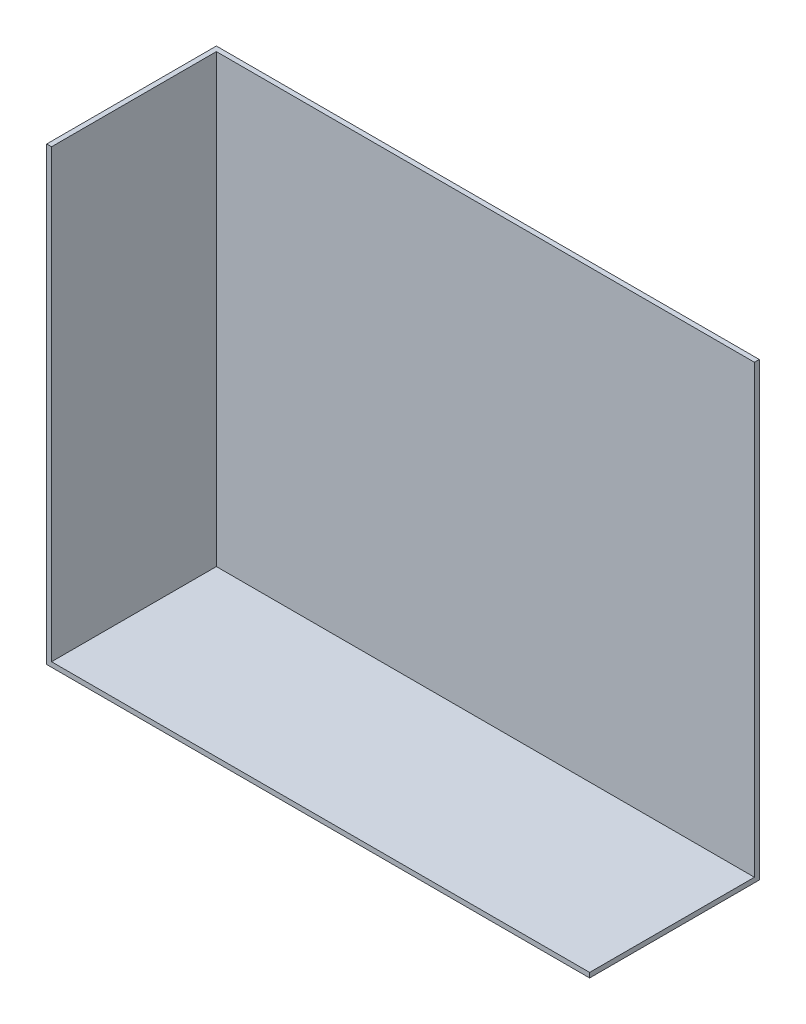
ISO-10303-21;
HEADER;
FILE_DESCRIPTION(('STEP AP214'),'2;1');
FILE_NAME('part.step','',(''),(''),'','','');
FILE_SCHEMA(('AUTOMOTIVE_DESIGN { 1 0 10303 214 1 1 1 1 }'));
ENDSEC;
DATA;
#1=APPLICATION_CONTEXT('core data for automotive mechanical design processes');
#2=APPLICATION_PROTOCOL_DEFINITION('international standard','automotive_design',2000,#1);
#3=PRODUCT_CONTEXT('',#1,'mechanical');
#4=PRODUCT('Part','Part','',(#3));
#5=PRODUCT_RELATED_PRODUCT_CATEGORY('part','',(#4));
#6=PRODUCT_DEFINITION_FORMATION('','',#4);
#7=PRODUCT_DEFINITION_CONTEXT('part definition',#1,'design');
#8=PRODUCT_DEFINITION('design','',#6,#7);
#9=PRODUCT_DEFINITION_SHAPE('','',#8);
#10=(LENGTH_UNIT() NAMED_UNIT(*) SI_UNIT(.MILLI.,.METRE.));
#11=(NAMED_UNIT(*) PLANE_ANGLE_UNIT() SI_UNIT($,.RADIAN.));
#12=(NAMED_UNIT(*) SI_UNIT($,.STERADIAN.) SOLID_ANGLE_UNIT());
#13=UNCERTAINTY_MEASURE_WITH_UNIT(LENGTH_MEASURE(1.E-05),#10,'distance_accuracy_value','');
#14=(GEOMETRIC_REPRESENTATION_CONTEXT(3) GLOBAL_UNCERTAINTY_ASSIGNED_CONTEXT((#13)) GLOBAL_UNIT_ASSIGNED_CONTEXT((#10,
#11,#12)) REPRESENTATION_CONTEXT('',''));
#15=CARTESIAN_POINT('',(0.,0.,0.));
#16=DIRECTION('',(0.,0.,1.));
#17=DIRECTION('',(1.,0.,0.));
#18=AXIS2_PLACEMENT_3D('',#15,#16,#17);
#19=CARTESIAN_POINT('',(1422.4,2362.2,444.5));
#20=DIRECTION('',(0.,0.,-1.));
#21=DIRECTION('',(-1.,0.,0.));
#22=AXIS2_PLACEMENT_3D('',#19,#20,#21);
#23=PLANE('',#22);
#24=DIRECTION('',(1.,0.,0.));
#25=VECTOR('',#24,1.);
#26=CARTESIAN_POINT('',(0.,25.4000000000001,444.5));
#27=LINE('',#26,#25);
#28=CARTESIAN_POINT('',(-1397.,25.4000000000001,444.5));
#29=VERTEX_POINT('',#28);
#30=CARTESIAN_POINT('',(1422.4,25.3999999999999,444.5));
#31=VERTEX_POINT('',#30);
#32=EDGE_CURVE('E130',#29,#31,#27,.T.);
#33=ORIENTED_EDGE('',*,*,#32,.F.);
#34=DIRECTION('',(0.,-1.,0.));
#35=VECTOR('',#34,1.);
#36=CARTESIAN_POINT('',(-1397.,2362.2,444.5));
#37=LINE('',#36,#35);
#38=CARTESIAN_POINT('',(-1397.,2362.2,444.5));
#39=VERTEX_POINT('',#38);
#40=EDGE_CURVE('E128',#39,#29,#37,.T.);
#41=ORIENTED_EDGE('',*,*,#40,.F.);
#42=DIRECTION('',(1.,0.,0.));
#43=VECTOR('',#42,1.);
#44=CARTESIAN_POINT('',(1422.4,2362.2,444.5));
#45=LINE('',#44,#43);
#46=CARTESIAN_POINT('',(-1422.4,2362.2,444.5));
#47=VERTEX_POINT('',#46);
#48=EDGE_CURVE('E89',#47,#39,#45,.T.);
#49=ORIENTED_EDGE('',*,*,#48,.F.);
#50=DIRECTION('',(0.,-1.,0.));
#51=VECTOR('',#50,1.);
#52=CARTESIAN_POINT('',(-1422.4,2362.2,444.5));
#53=LINE('',#52,#51);
#54=CARTESIAN_POINT('',(-1422.4,0.,444.5));
#55=VERTEX_POINT('',#54);
#56=EDGE_CURVE('E11',#47,#55,#53,.T.);
#57=ORIENTED_EDGE('',*,*,#56,.T.);
#58=DIRECTION('',(1.,0.,0.));
#59=VECTOR('',#58,1.);
#60=CARTESIAN_POINT('',(1422.4,0.,444.5));
#61=LINE('',#60,#59);
#62=CARTESIAN_POINT('',(1422.4,0.,444.5));
#63=VERTEX_POINT('',#62);
#64=EDGE_CURVE('E161',#55,#63,#61,.T.);
#65=ORIENTED_EDGE('',*,*,#64,.T.);
#66=DIRECTION('',(0.,-1.,0.));
#67=VECTOR('',#66,1.);
#68=CARTESIAN_POINT('',(1422.4,2362.2,444.5));
#69=LINE('',#68,#67);
#70=EDGE_CURVE('E47',#31,#63,#69,.T.);
#71=ORIENTED_EDGE('',*,*,#70,.F.);
#72=EDGE_LOOP('',(#33,#41,#49,#57,#65,#71));
#73=FACE_BOUND('',#72,.T.);
#74=ADVANCED_FACE('F38',(#73),#23,.F.);
#75=CARTESIAN_POINT('',(1422.4,2362.2,-444.5));
#76=DIRECTION('',(-1.,0.,0.));
#77=DIRECTION('',(0.,0.,1.));
#78=AXIS2_PLACEMENT_3D('',#75,#76,#77);
#79=PLANE('',#78);
#80=DIRECTION('',(0.,0.,-1.));
#81=VECTOR('',#80,1.);
#82=CARTESIAN_POINT('',(1422.4,25.4000000000001,0.));
#83=LINE('',#82,#81);
#84=CARTESIAN_POINT('',(1422.4,25.4000000000001,-419.1));
#85=VERTEX_POINT('',#84);
#86=EDGE_CURVE('E115',#31,#85,#83,.T.);
#87=ORIENTED_EDGE('',*,*,#86,.F.);
#88=ORIENTED_EDGE('',*,*,#70,.T.);
#89=DIRECTION('',(0.,0.,-1.));
#90=VECTOR('',#89,1.);
#91=CARTESIAN_POINT('',(1422.4,0.,-444.5));
#92=LINE('',#91,#90);
#93=CARTESIAN_POINT('',(1422.4,0.,-444.5));
#94=VERTEX_POINT('',#93);
#95=EDGE_CURVE('E165',#63,#94,#92,.T.);
#96=ORIENTED_EDGE('',*,*,#95,.T.);
#97=DIRECTION('',(0.,-1.,0.));
#98=VECTOR('',#97,1.);
#99=CARTESIAN_POINT('',(1422.4,2362.2,-444.5));
#100=LINE('',#99,#98);
#101=CARTESIAN_POINT('',(1422.4,2362.2,-444.5));
#102=VERTEX_POINT('',#101);
#103=EDGE_CURVE('E172',#102,#94,#100,.T.);
#104=ORIENTED_EDGE('',*,*,#103,.F.);
#105=DIRECTION('',(0.,0.,-1.));
#106=VECTOR('',#105,1.);
#107=CARTESIAN_POINT('',(1422.4,2362.2,-444.5));
#108=LINE('',#107,#106);
#109=CARTESIAN_POINT('',(1422.4,2362.2,-419.1));
#110=VERTEX_POINT('',#109);
#111=EDGE_CURVE('E152',#110,#102,#108,.T.);
#112=ORIENTED_EDGE('',*,*,#111,.F.);
#113=DIRECTION('',(0.,-1.,0.));
#114=VECTOR('',#113,1.);
#115=CARTESIAN_POINT('',(1422.4,2362.2,-419.1));
#116=LINE('',#115,#114);
#117=EDGE_CURVE('E54',#110,#85,#116,.T.);
#118=ORIENTED_EDGE('',*,*,#117,.T.);
#119=EDGE_LOOP('',(#87,#88,#96,#104,#112,#118));
#120=FACE_BOUND('',#119,.T.);
#121=ADVANCED_FACE('F178',(#120),#79,.F.);
#122=CARTESIAN_POINT('',(0.,2362.2,0.));
#123=DIRECTION('',(0.,-1.,0.));
#124=DIRECTION('',(0.,0.,-1.));
#125=AXIS2_PLACEMENT_3D('',#122,#123,#124);
#126=PLANE('',#125);
#127=DIRECTION('',(0.,0.,1.));
#128=VECTOR('',#127,1.);
#129=CARTESIAN_POINT('',(-1397.,2362.2,0.));
#130=LINE('',#129,#128);
#131=CARTESIAN_POINT('',(-1397.,2362.2,-419.1));
#132=VERTEX_POINT('',#131);
#133=EDGE_CURVE('E117',#132,#39,#130,.T.);
#134=ORIENTED_EDGE('',*,*,#133,.F.);
#135=DIRECTION('',(-1.,0.,0.));
#136=VECTOR('',#135,1.);
#137=CARTESIAN_POINT('',(0.,2362.2,-419.1));
#138=LINE('',#137,#136);
#139=EDGE_CURVE('E122',#110,#132,#138,.T.);
#140=ORIENTED_EDGE('',*,*,#139,.F.);
#141=ORIENTED_EDGE('',*,*,#111,.T.);
#142=DIRECTION('',(-1.,0.,0.));
#143=VECTOR('',#142,1.);
#144=CARTESIAN_POINT('',(1422.4,2362.2,-444.5));
#145=LINE('',#144,#143);
#146=CARTESIAN_POINT('',(-1422.4,2362.2,-444.5));
#147=VERTEX_POINT('',#146);
#148=EDGE_CURVE('E63',#102,#147,#145,.T.);
#149=ORIENTED_EDGE('',*,*,#148,.T.);
#150=DIRECTION('',(0.,0.,1.));
#151=VECTOR('',#150,1.);
#152=CARTESIAN_POINT('',(-1422.4,2362.2,-444.5));
#153=LINE('',#152,#151);
#154=EDGE_CURVE('E147',#147,#47,#153,.T.);
#155=ORIENTED_EDGE('',*,*,#154,.T.);
#156=ORIENTED_EDGE('',*,*,#48,.T.);
#157=EDGE_LOOP('',(#134,#140,#141,#149,#155,#156));
#158=FACE_BOUND('',#157,.T.);
#159=ADVANCED_FACE('F189',(#158),#126,.F.);
#160=CARTESIAN_POINT('',(-1422.4,2362.2,-444.5));
#161=DIRECTION('',(1.,0.,0.));
#162=DIRECTION('',(0.,0.,-1.));
#163=AXIS2_PLACEMENT_3D('',#160,#161,#162);
#164=PLANE('',#163);
#165=DIRECTION('',(0.,0.,1.));
#166=VECTOR('',#165,1.);
#167=CARTESIAN_POINT('',(-1422.4,0.,-444.5));
#168=LINE('',#167,#166);
#169=CARTESIAN_POINT('',(-1422.4,0.,-444.5));
#170=VERTEX_POINT('',#169);
#171=EDGE_CURVE('E137',#170,#55,#168,.T.);
#172=ORIENTED_EDGE('',*,*,#171,.T.);
#173=ORIENTED_EDGE('',*,*,#56,.F.);
#174=ORIENTED_EDGE('',*,*,#154,.F.);
#175=DIRECTION('',(0.,-1.,0.));
#176=VECTOR('',#175,1.);
#177=CARTESIAN_POINT('',(-1422.4,2362.2,-444.5));
#178=LINE('',#177,#176);
#179=EDGE_CURVE('E157',#147,#170,#178,.T.);
#180=ORIENTED_EDGE('',*,*,#179,.T.);
#181=EDGE_LOOP('',(#172,#173,#174,#180));
#182=FACE_BOUND('',#181,.T.);
#183=ADVANCED_FACE('F40',(#182),#164,.F.);
#184=CARTESIAN_POINT('',(1422.4,2362.2,-444.5));
#185=DIRECTION('',(0.,0.,1.));
#186=DIRECTION('',(1.,0.,0.));
#187=AXIS2_PLACEMENT_3D('',#184,#185,#186);
#188=PLANE('',#187);
#189=DIRECTION('',(-1.,0.,0.));
#190=VECTOR('',#189,1.);
#191=CARTESIAN_POINT('',(1422.4,0.,-444.5));
#192=LINE('',#191,#190);
#193=EDGE_CURVE('E83',#94,#170,#192,.T.);
#194=ORIENTED_EDGE('',*,*,#193,.T.);
#195=ORIENTED_EDGE('',*,*,#179,.F.);
#196=ORIENTED_EDGE('',*,*,#148,.F.);
#197=ORIENTED_EDGE('',*,*,#103,.T.);
#198=EDGE_LOOP('',(#194,#195,#196,#197));
#199=FACE_BOUND('',#198,.T.);
#200=ADVANCED_FACE('F187',(#199),#188,.F.);
#201=CARTESIAN_POINT('',(0.,0.,0.));
#202=DIRECTION('',(0.,-1.,0.));
#203=DIRECTION('',(0.,0.,-1.));
#204=AXIS2_PLACEMENT_3D('',#201,#202,#203);
#205=PLANE('',#204);
#206=ORIENTED_EDGE('',*,*,#171,.F.);
#207=ORIENTED_EDGE('',*,*,#193,.F.);
#208=ORIENTED_EDGE('',*,*,#95,.F.);
#209=ORIENTED_EDGE('',*,*,#64,.F.);
#210=EDGE_LOOP('',(#206,#207,#208,#209));
#211=FACE_BOUND('',#210,.T.);
#212=ADVANCED_FACE('F184',(#211),#205,.T.);
#213=CARTESIAN_POINT('',(-1397.,2362.2,-444.5));
#214=DIRECTION('',(1.,0.,0.));
#215=DIRECTION('',(0.,0.,-1.));
#216=AXIS2_PLACEMENT_3D('',#213,#214,#215);
#217=PLANE('',#216);
#218=DIRECTION('',(0.,0.,1.));
#219=VECTOR('',#218,1.);
#220=CARTESIAN_POINT('',(-1397.,25.4000000000001,0.));
#221=LINE('',#220,#219);
#222=CARTESIAN_POINT('',(-1397.,25.4000000000001,-419.1));
#223=VERTEX_POINT('',#222);
#224=EDGE_CURVE('E112',#223,#29,#221,.T.);
#225=ORIENTED_EDGE('',*,*,#224,.F.);
#226=DIRECTION('',(0.,-1.,0.));
#227=VECTOR('',#226,1.);
#228=CARTESIAN_POINT('',(-1397.,2362.2,-419.1));
#229=LINE('',#228,#227);
#230=EDGE_CURVE('E120',#132,#223,#229,.T.);
#231=ORIENTED_EDGE('',*,*,#230,.F.);
#232=ORIENTED_EDGE('',*,*,#133,.T.);
#233=ORIENTED_EDGE('',*,*,#40,.T.);
#234=EDGE_LOOP('',(#225,#231,#232,#233));
#235=FACE_BOUND('',#234,.T.);
#236=ADVANCED_FACE('F127',(#235),#217,.T.);
#237=CARTESIAN_POINT('',(1422.4,2362.2,-419.1));
#238=DIRECTION('',(0.,0.,1.));
#239=DIRECTION('',(1.,0.,0.));
#240=AXIS2_PLACEMENT_3D('',#237,#238,#239);
#241=PLANE('',#240);
#242=DIRECTION('',(-1.,0.,0.));
#243=VECTOR('',#242,1.);
#244=CARTESIAN_POINT('',(0.,25.4000000000001,-419.1));
#245=LINE('',#244,#243);
#246=EDGE_CURVE('E108',#85,#223,#245,.T.);
#247=ORIENTED_EDGE('',*,*,#246,.F.);
#248=ORIENTED_EDGE('',*,*,#117,.F.);
#249=ORIENTED_EDGE('',*,*,#139,.T.);
#250=ORIENTED_EDGE('',*,*,#230,.T.);
#251=EDGE_LOOP('',(#247,#248,#249,#250));
#252=FACE_BOUND('',#251,.T.);
#253=ADVANCED_FACE('F121',(#252),#241,.T.);
#254=CARTESIAN_POINT('',(0.,25.4000000000001,0.));
#255=DIRECTION('',(0.,-1.,0.));
#256=DIRECTION('',(0.,0.,-1.));
#257=AXIS2_PLACEMENT_3D('',#254,#255,#256);
#258=PLANE('',#257);
#259=ORIENTED_EDGE('',*,*,#224,.T.);
#260=ORIENTED_EDGE('',*,*,#32,.T.);
#261=ORIENTED_EDGE('',*,*,#86,.T.);
#262=ORIENTED_EDGE('',*,*,#246,.T.);
#263=EDGE_LOOP('',(#259,#260,#261,#262));
#264=FACE_BOUND('',#263,.T.);
#265=ADVANCED_FACE('F110',(#264),#258,.F.);
#266=CLOSED_SHELL('',(#74,#121,#159,#183,#200,#212,#236,#253,#265));
#267=MANIFOLD_SOLID_BREP('B2',#266);
#268=ADVANCED_BREP_SHAPE_REPRESENTATION('',(#18,#267),#14);
#269=SHAPE_DEFINITION_REPRESENTATION(#9,#268);
ENDSEC;
END-ISO-10303-21;
